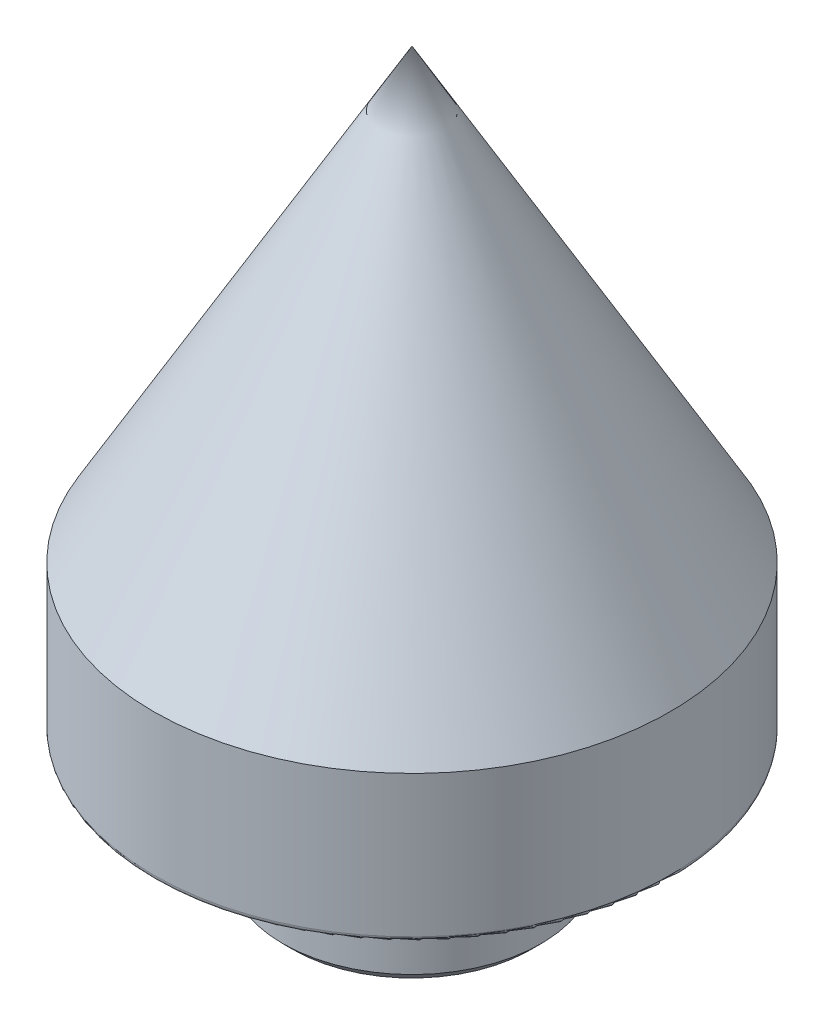
ISO-10303-21;
HEADER;
FILE_DESCRIPTION(('STEP AP214'),'2;1');
FILE_NAME('part.step','',(''),(''),'','','');
FILE_SCHEMA(('AUTOMOTIVE_DESIGN { 1 0 10303 214 1 1 1 1 }'));
ENDSEC;
DATA;
#1=APPLICATION_CONTEXT('core data for automotive mechanical design processes');
#2=APPLICATION_PROTOCOL_DEFINITION('international standard','automotive_design',2000,#1);
#3=PRODUCT_CONTEXT('',#1,'mechanical');
#4=PRODUCT('Part','Part','',(#3));
#5=PRODUCT_RELATED_PRODUCT_CATEGORY('part','',(#4));
#6=PRODUCT_DEFINITION_FORMATION('','',#4);
#7=PRODUCT_DEFINITION_CONTEXT('part definition',#1,'design');
#8=PRODUCT_DEFINITION('design','',#6,#7);
#9=PRODUCT_DEFINITION_SHAPE('','',#8);
#10=(LENGTH_UNIT() NAMED_UNIT(*) SI_UNIT(.MILLI.,.METRE.));
#11=(NAMED_UNIT(*) PLANE_ANGLE_UNIT() SI_UNIT($,.RADIAN.));
#12=(NAMED_UNIT(*) SI_UNIT($,.STERADIAN.) SOLID_ANGLE_UNIT());
#13=UNCERTAINTY_MEASURE_WITH_UNIT(LENGTH_MEASURE(1.E-05),#10,'distance_accuracy_value','');
#14=(GEOMETRIC_REPRESENTATION_CONTEXT(3) GLOBAL_UNCERTAINTY_ASSIGNED_CONTEXT((#13)) GLOBAL_UNIT_ASSIGNED_CONTEXT((#10,
#11,#12)) REPRESENTATION_CONTEXT('',''));
#15=CARTESIAN_POINT('',(0.,0.,0.));
#16=DIRECTION('',(0.,0.,1.));
#17=DIRECTION('',(1.,0.,0.));
#18=AXIS2_PLACEMENT_3D('',#15,#16,#17);
#19=CARTESIAN_POINT('',(12.7,0.,0.));
#20=DIRECTION('',(0.,1.,0.));
#21=DIRECTION('',(0.,0.,1.));
#22=AXIS2_PLACEMENT_3D('',#19,#20,#21);
#23=PLANE('',#22);
#24=CARTESIAN_POINT('',(0.,0.,0.));
#25=DIRECTION('',(0.,1.,0.));
#26=DIRECTION('',(0.,0.,1.));
#27=AXIS2_PLACEMENT_3D('',#24,#25,#26);
#28=CIRCLE('',#27,12.446);
#29=CARTESIAN_POINT('',(0.,0.,12.446));
#30=VERTEX_POINT('',#29);
#31=EDGE_CURVE('E11',#30,#30,#28,.F.);
#32=ORIENTED_EDGE('',*,*,#31,.T.);
#33=EDGE_LOOP('',(#32));
#34=FACE_BOUND('',#33,.T.);
#35=CARTESIAN_POINT('',(0.,0.,0.));
#36=DIRECTION('',(0.,1.,0.));
#37=DIRECTION('',(0.,0.,1.));
#38=AXIS2_PLACEMENT_3D('',#35,#36,#37);
#39=CIRCLE('',#38,7.42596126628495);
#40=CARTESIAN_POINT('',(0.,0.,7.42596126628495));
#41=VERTEX_POINT('',#40);
#42=EDGE_CURVE('E65',#41,#41,#39,.F.);
#43=ORIENTED_EDGE('',*,*,#42,.F.);
#44=EDGE_LOOP('',(#43));
#45=FACE_BOUND('',#44,.T.);
#46=ADVANCED_FACE('F33',(#34,#45),#23,.F.);
#47=CARTESIAN_POINT('',(0.,35.2893442622951,0.));
#48=DIRECTION('',(0.,1.,0.));
#49=DIRECTION('',(0.,0.,1.));
#50=AXIS2_PLACEMENT_3D('',#47,#48,#49);
#51=CYLINDRICAL_SURFACE('',#50,12.7);
#52=CARTESIAN_POINT('',(0.,0.253999999999997,0.));
#53=DIRECTION('',(0.,1.,0.));
#54=DIRECTION('',(0.,0.,1.));
#55=AXIS2_PLACEMENT_3D('',#52,#53,#54);
#56=CIRCLE('',#55,12.7);
#57=CARTESIAN_POINT('',(0.,0.253999999999997,12.7));
#58=VERTEX_POINT('',#57);
#59=EDGE_CURVE('E41',#58,#58,#56,.T.);
#60=ORIENTED_EDGE('',*,*,#59,.T.);
#61=EDGE_LOOP('',(#60));
#62=FACE_BOUND('',#61,.T.);
#63=CARTESIAN_POINT('',(0.,7.21295474387532,0.));
#64=DIRECTION('',(0.,1.,0.));
#65=DIRECTION('',(0.,0.,1.));
#66=AXIS2_PLACEMENT_3D('',#63,#64,#65);
#67=CIRCLE('',#66,12.7);
#68=CARTESIAN_POINT('',(0.,7.21295474387532,12.7));
#69=VERTEX_POINT('',#68);
#70=EDGE_CURVE('E68',#69,#69,#67,.T.);
#71=ORIENTED_EDGE('',*,*,#70,.F.);
#72=EDGE_LOOP('',(#71));
#73=FACE_BOUND('',#72,.T.);
#74=ADVANCED_FACE('F35',(#62,#73),#51,.T.);
#75=CARTESIAN_POINT('',(0.,7.21295474387532,0.));
#76=DIRECTION('',(0.,-1.,0.));
#77=DIRECTION('',(0.,0.,-1.));
#78=AXIS2_PLACEMENT_3D('',#75,#76,#77);
#79=CONICAL_SURFACE('',#78,12.7,0.523598775598301);
#80=CARTESIAN_POINT('',(0.,29.21,0.));
#81=VERTEX_POINT('',#80);
#82=VERTEX_LOOP('',#81);
#83=FACE_BOUND('',#82,.T.);
#84=ORIENTED_EDGE('',*,*,#70,.T.);
#85=EDGE_LOOP('',(#84));
#86=FACE_BOUND('',#85,.T.);
#87=ADVANCED_FACE('F104',(#83,#86),#79,.T.);
#88=CARTESIAN_POINT('',(0.,-0.508,0.));
#89=DIRECTION('',(0.,1.,0.));
#90=DIRECTION('',(0.,0.,1.));
#91=AXIS2_PLACEMENT_3D('',#88,#89,#90);
#92=TOROIDAL_SURFACE('',#91,6.85800000000001,0.761999999999999);
#93=CARTESIAN_POINT('',(0.,-1.07596126628495,0.));
#94=DIRECTION('',(0.,1.,0.));
#95=DIRECTION('',(0.,0.,1.));
#96=AXIS2_PLACEMENT_3D('',#93,#94,#95);
#97=CIRCLE('',#96,6.35000000000001);
#98=CARTESIAN_POINT('',(0.,-1.07596126628495,6.35000000000001));
#99=VERTEX_POINT('',#98);
#100=EDGE_CURVE('E64',#99,#99,#97,.T.);
#101=ORIENTED_EDGE('',*,*,#100,.T.);
#102=EDGE_LOOP('',(#101));
#103=FACE_BOUND('',#102,.T.);
#104=ORIENTED_EDGE('',*,*,#42,.T.);
#105=EDGE_LOOP('',(#104));
#106=FACE_BOUND('',#105,.T.);
#107=ADVANCED_FACE('F113',(#103,#106),#92,.F.);
#108=CARTESIAN_POINT('',(6.35000000000001,-6.35,0.));
#109=DIRECTION('',(0.,1.,0.));
#110=DIRECTION('',(0.,0.,1.));
#111=AXIS2_PLACEMENT_3D('',#108,#109,#110);
#112=PLANE('',#111);
#113=CARTESIAN_POINT('',(0.,-6.35,0.));
#114=DIRECTION('',(0.,-1.,0.));
#115=DIRECTION('',(0.,0.,-1.));
#116=AXIS2_PLACEMENT_3D('',#113,#114,#115);
#117=CIRCLE('',#116,2.413);
#118=CARTESIAN_POINT('',(0.,-6.35,-2.413));
#119=VERTEX_POINT('',#118);
#120=EDGE_CURVE('E59',#119,#119,#117,.T.);
#121=ORIENTED_EDGE('',*,*,#120,.F.);
#122=EDGE_LOOP('',(#121));
#123=FACE_BOUND('',#122,.T.);
#124=CARTESIAN_POINT('',(0.,-6.35,0.));
#125=DIRECTION('',(0.,1.,0.));
#126=DIRECTION('',(0.,0.,1.));
#127=AXIS2_PLACEMENT_3D('',#124,#125,#126);
#128=CIRCLE('',#127,5.842);
#129=CARTESIAN_POINT('',(0.,-6.35,5.842));
#130=VERTEX_POINT('',#129);
#131=EDGE_CURVE('E76',#130,#130,#128,.F.);
#132=ORIENTED_EDGE('',*,*,#131,.T.);
#133=EDGE_LOOP('',(#132));
#134=FACE_BOUND('',#133,.T.);
#135=ADVANCED_FACE('F109',(#123,#134),#112,.F.);
#136=CARTESIAN_POINT('',(0.,35.2893442622951,0.));
#137=DIRECTION('',(0.,1.,0.));
#138=DIRECTION('',(0.,0.,1.));
#139=AXIS2_PLACEMENT_3D('',#136,#137,#138);
#140=CYLINDRICAL_SURFACE('',#139,6.35000000000001);
#141=CARTESIAN_POINT('',(0.,-5.842,0.));
#142=DIRECTION('',(0.,1.,0.));
#143=DIRECTION('',(0.,0.,1.));
#144=AXIS2_PLACEMENT_3D('',#141,#142,#143);
#145=CIRCLE('',#144,6.35000000000001);
#146=CARTESIAN_POINT('',(0.,-5.842,6.35000000000001));
#147=VERTEX_POINT('',#146);
#148=EDGE_CURVE('E71',#147,#147,#145,.T.);
#149=ORIENTED_EDGE('',*,*,#148,.T.);
#150=EDGE_LOOP('',(#149));
#151=FACE_BOUND('',#150,.T.);
#152=ORIENTED_EDGE('',*,*,#100,.F.);
#153=EDGE_LOOP('',(#152));
#154=FACE_BOUND('',#153,.T.);
#155=ADVANCED_FACE('F95',(#151,#154),#140,.T.);
#156=CARTESIAN_POINT('',(0.,-5.842,0.));
#157=DIRECTION('',(0.,1.,0.));
#158=DIRECTION('',(0.,0.,1.));
#159=AXIS2_PLACEMENT_3D('',#156,#157,#158);
#160=CONICAL_SURFACE('',#159,6.35000000000001,0.785398163397447);
#161=ORIENTED_EDGE('',*,*,#131,.F.);
#162=EDGE_LOOP('',(#161));
#163=FACE_BOUND('',#162,.T.);
#164=ORIENTED_EDGE('',*,*,#148,.F.);
#165=EDGE_LOOP('',(#164));
#166=FACE_BOUND('',#165,.T.);
#167=ADVANCED_FACE('F86',(#163,#166),#160,.T.);
#168=CARTESIAN_POINT('',(0.,0.253999999999997,0.));
#169=DIRECTION('',(0.,1.,0.));
#170=DIRECTION('',(0.,0.,1.));
#171=AXIS2_PLACEMENT_3D('',#168,#169,#170);
#172=TOROIDAL_SURFACE('',#171,12.446,0.254);
#173=ORIENTED_EDGE('',*,*,#31,.F.);
#174=EDGE_LOOP('',(#173));
#175=FACE_BOUND('',#174,.T.);
#176=ORIENTED_EDGE('',*,*,#59,.F.);
#177=EDGE_LOOP('',(#176));
#178=FACE_BOUND('',#177,.T.);
#179=ADVANCED_FACE('F83',(#175,#178),#172,.T.);
#180=CARTESIAN_POINT('',(0.,-6.35,0.));
#181=DIRECTION('',(0.,-1.,0.));
#182=DIRECTION('',(0.,0.,-1.));
#183=AXIS2_PLACEMENT_3D('',#180,#181,#182);
#184=CONICAL_SURFACE('',#183,2.413,0.785398163397447);
#185=CARTESIAN_POINT('',(0.,-5.9563,0.));
#186=DIRECTION('',(0.,-1.,0.));
#187=DIRECTION('',(0.,0.,-1.));
#188=AXIS2_PLACEMENT_3D('',#185,#186,#187);
#189=CIRCLE('',#188,2.0193);
#190=CARTESIAN_POINT('',(0.,-5.9563,-2.0193));
#191=VERTEX_POINT('',#190);
#192=EDGE_CURVE('E56',#191,#191,#189,.T.);
#193=ORIENTED_EDGE('',*,*,#192,.F.);
#194=EDGE_LOOP('',(#193));
#195=FACE_BOUND('',#194,.T.);
#196=ORIENTED_EDGE('',*,*,#120,.T.);
#197=EDGE_LOOP('',(#196));
#198=FACE_BOUND('',#197,.T.);
#199=ADVANCED_FACE('F85',(#195,#198),#184,.F.);
#200=CARTESIAN_POINT('',(0.,-6.35,0.));
#201=DIRECTION('',(0.,-1.,0.));
#202=DIRECTION('',(0.,0.,-1.));
#203=AXIS2_PLACEMENT_3D('',#200,#201,#202);
#204=CYLINDRICAL_SURFACE('',#203,2.0193);
#205=CARTESIAN_POINT('',(0.,3.9624,0.));
#206=DIRECTION('',(0.,-1.,0.));
#207=DIRECTION('',(0.,0.,-1.));
#208=AXIS2_PLACEMENT_3D('',#205,#206,#207);
#209=CIRCLE('',#208,2.0193);
#210=CARTESIAN_POINT('',(0.,3.9624,-2.0193));
#211=VERTEX_POINT('',#210);
#212=EDGE_CURVE('E54',#211,#211,#209,.T.);
#213=ORIENTED_EDGE('',*,*,#212,.F.);
#214=EDGE_LOOP('',(#213));
#215=FACE_BOUND('',#214,.T.);
#216=ORIENTED_EDGE('',*,*,#192,.T.);
#217=EDGE_LOOP('',(#216));
#218=FACE_BOUND('',#217,.T.);
#219=ADVANCED_FACE('F50',(#215,#218),#204,.F.);
#220=CARTESIAN_POINT('',(0.,3.9624,0.));
#221=DIRECTION('',(0.,-1.,0.));
#222=DIRECTION('',(0.,0.,-1.));
#223=AXIS2_PLACEMENT_3D('',#220,#221,#222);
#224=CONICAL_SURFACE('',#223,2.0193,1.02974425867665);
#225=CARTESIAN_POINT('',(0.,5.17571784800235,0.));
#226=VERTEX_POINT('',#225);
#227=VERTEX_LOOP('',#226);
#228=FACE_BOUND('',#227,.T.);
#229=ORIENTED_EDGE('',*,*,#212,.T.);
#230=EDGE_LOOP('',(#229));
#231=FACE_BOUND('',#230,.T.);
#232=ADVANCED_FACE('F47',(#228,#231),#224,.F.);
#233=CLOSED_SHELL('',(#46,#74,#87,#107,#135,#155,#167,#179,#199,#219,#232));
#234=MANIFOLD_SOLID_BREP('B2',#233);
#235=ADVANCED_BREP_SHAPE_REPRESENTATION('',(#18,#234),#14);
#236=SHAPE_DEFINITION_REPRESENTATION(#9,#235);
ENDSEC;
END-ISO-10303-21;
